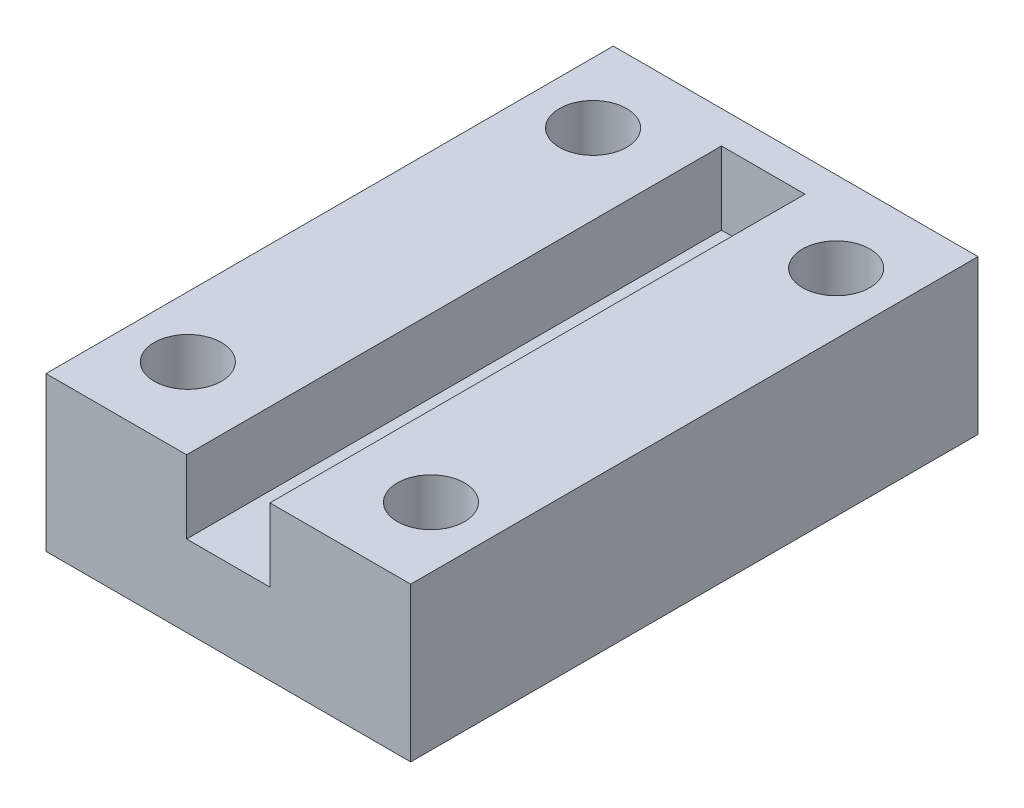
ISO-10303-21;
HEADER;
FILE_DESCRIPTION(('STEP AP214'),'2;1');
FILE_NAME('part.step','',(''),(''),'','','');
FILE_SCHEMA(('AUTOMOTIVE_DESIGN { 1 0 10303 214 1 1 1 1 }'));
ENDSEC;
DATA;
#1=APPLICATION_CONTEXT('core data for automotive mechanical design processes');
#2=APPLICATION_PROTOCOL_DEFINITION('international standard','automotive_design',2000,#1);
#3=PRODUCT_CONTEXT('',#1,'mechanical');
#4=PRODUCT('Part','Part','',(#3));
#5=PRODUCT_RELATED_PRODUCT_CATEGORY('part','',(#4));
#6=PRODUCT_DEFINITION_FORMATION('','',#4);
#7=PRODUCT_DEFINITION_CONTEXT('part definition',#1,'design');
#8=PRODUCT_DEFINITION('design','',#6,#7);
#9=PRODUCT_DEFINITION_SHAPE('','',#8);
#10=(LENGTH_UNIT() NAMED_UNIT(*) SI_UNIT(.MILLI.,.METRE.));
#11=(NAMED_UNIT(*) PLANE_ANGLE_UNIT() SI_UNIT($,.RADIAN.));
#12=(NAMED_UNIT(*) SI_UNIT($,.STERADIAN.) SOLID_ANGLE_UNIT());
#13=UNCERTAINTY_MEASURE_WITH_UNIT(LENGTH_MEASURE(1.E-05),#10,'distance_accuracy_value','');
#14=(GEOMETRIC_REPRESENTATION_CONTEXT(3) GLOBAL_UNCERTAINTY_ASSIGNED_CONTEXT((#13)) GLOBAL_UNIT_ASSIGNED_CONTEXT((#10,
#11,#12)) REPRESENTATION_CONTEXT('',''));
#15=CARTESIAN_POINT('',(0.,0.,0.));
#16=DIRECTION('',(0.,0.,1.));
#17=DIRECTION('',(1.,0.,0.));
#18=AXIS2_PLACEMENT_3D('',#15,#16,#17);
#19=CARTESIAN_POINT('',(-22.5,10.,35.));
#20=DIRECTION('',(1.,0.,0.));
#21=DIRECTION('',(0.,0.,-1.));
#22=AXIS2_PLACEMENT_3D('',#19,#20,#21);
#23=PLANE('',#22);
#24=DIRECTION('',(0.,0.,1.));
#25=VECTOR('',#24,1.);
#26=CARTESIAN_POINT('',(-22.5,0.,35.));
#27=LINE('',#26,#25);
#28=CARTESIAN_POINT('',(-22.5,0.,-35.));
#29=VERTEX_POINT('',#28);
#30=CARTESIAN_POINT('',(-22.5,0.,35.));
#31=VERTEX_POINT('',#30);
#32=EDGE_CURVE('E170',#29,#31,#27,.T.);
#33=ORIENTED_EDGE('',*,*,#32,.T.);
#34=DIRECTION('',(0.,-1.,0.));
#35=VECTOR('',#34,1.);
#36=CARTESIAN_POINT('',(-22.5,10.,35.));
#37=LINE('',#36,#35);
#38=CARTESIAN_POINT('',(-22.5,19.,35.));
#39=VERTEX_POINT('',#38);
#40=EDGE_CURVE('E120',#39,#31,#37,.T.);
#41=ORIENTED_EDGE('',*,*,#40,.F.);
#42=DIRECTION('',(0.,0.,1.));
#43=VECTOR('',#42,1.);
#44=CARTESIAN_POINT('',(-22.5,19.,35.));
#45=LINE('',#44,#43);
#46=CARTESIAN_POINT('',(-22.5,19.,-35.));
#47=VERTEX_POINT('',#46);
#48=EDGE_CURVE('E118',#47,#39,#45,.T.);
#49=ORIENTED_EDGE('',*,*,#48,.F.);
#50=DIRECTION('',(0.,-1.,0.));
#51=VECTOR('',#50,1.);
#52=CARTESIAN_POINT('',(-22.5,10.,-35.));
#53=LINE('',#52,#51);
#54=EDGE_CURVE('E103',#47,#29,#53,.T.);
#55=ORIENTED_EDGE('',*,*,#54,.T.);
#56=EDGE_LOOP('',(#33,#41,#49,#55));
#57=FACE_BOUND('',#56,.T.);
#58=ADVANCED_FACE('F34',(#57),#23,.F.);
#59=CARTESIAN_POINT('',(22.5,10.,35.));
#60=DIRECTION('',(0.,0.,-1.));
#61=DIRECTION('',(-1.,0.,0.));
#62=AXIS2_PLACEMENT_3D('',#59,#60,#61);
#63=PLANE('',#62);
#64=DIRECTION('',(1.,0.,0.));
#65=VECTOR('',#64,1.);
#66=CARTESIAN_POINT('',(22.5,0.,35.));
#67=LINE('',#66,#65);
#68=CARTESIAN_POINT('',(22.5,0.,35.));
#69=VERTEX_POINT('',#68);
#70=EDGE_CURVE('E173',#31,#69,#67,.T.);
#71=ORIENTED_EDGE('',*,*,#70,.T.);
#72=DIRECTION('',(0.,-1.,0.));
#73=VECTOR('',#72,1.);
#74=CARTESIAN_POINT('',(22.5,10.,35.));
#75=LINE('',#74,#73);
#76=CARTESIAN_POINT('',(22.5,19.,35.));
#77=VERTEX_POINT('',#76);
#78=EDGE_CURVE('E179',#77,#69,#75,.T.);
#79=ORIENTED_EDGE('',*,*,#78,.F.);
#80=DIRECTION('',(1.,0.,0.));
#81=VECTOR('',#80,1.);
#82=CARTESIAN_POINT('',(5.15,19.,35.));
#83=LINE('',#82,#81);
#84=CARTESIAN_POINT('',(5.15,19.,35.));
#85=VERTEX_POINT('',#84);
#86=EDGE_CURVE('E146',#85,#77,#83,.T.);
#87=ORIENTED_EDGE('',*,*,#86,.F.);
#88=DIRECTION('',(0.,-1.,0.));
#89=VECTOR('',#88,1.);
#90=CARTESIAN_POINT('',(5.15,19.,35.));
#91=LINE('',#90,#89);
#92=CARTESIAN_POINT('',(5.15,10.,35.));
#93=VERTEX_POINT('',#92);
#94=EDGE_CURVE('E149',#85,#93,#91,.T.);
#95=ORIENTED_EDGE('',*,*,#94,.T.);
#96=DIRECTION('',(1.,0.,0.));
#97=VECTOR('',#96,1.);
#98=CARTESIAN_POINT('',(22.5,10.,35.));
#99=LINE('',#98,#97);
#100=CARTESIAN_POINT('',(-5.15,10.,35.));
#101=VERTEX_POINT('',#100);
#102=EDGE_CURVE('E115',#101,#93,#99,.T.);
#103=ORIENTED_EDGE('',*,*,#102,.F.);
#104=DIRECTION('',(0.,-1.,0.));
#105=VECTOR('',#104,1.);
#106=CARTESIAN_POINT('',(-5.15,19.,35.));
#107=LINE('',#106,#105);
#108=CARTESIAN_POINT('',(-5.15,19.,35.));
#109=VERTEX_POINT('',#108);
#110=EDGE_CURVE('E167',#109,#101,#107,.T.);
#111=ORIENTED_EDGE('',*,*,#110,.F.);
#112=DIRECTION('',(1.,0.,0.));
#113=VECTOR('',#112,1.);
#114=CARTESIAN_POINT('',(-5.15,19.,35.));
#115=LINE('',#114,#113);
#116=EDGE_CURVE('E123',#39,#109,#115,.T.);
#117=ORIENTED_EDGE('',*,*,#116,.F.);
#118=ORIENTED_EDGE('',*,*,#40,.T.);
#119=EDGE_LOOP('',(#71,#79,#87,#95,#103,#111,#117,#118));
#120=FACE_BOUND('',#119,.T.);
#121=ADVANCED_FACE('F220',(#120),#63,.F.);
#122=CARTESIAN_POINT('',(22.5,10.,35.));
#123=DIRECTION('',(-1.,0.,0.));
#124=DIRECTION('',(0.,0.,1.));
#125=AXIS2_PLACEMENT_3D('',#122,#123,#124);
#126=PLANE('',#125);
#127=DIRECTION('',(0.,0.,-1.));
#128=VECTOR('',#127,1.);
#129=CARTESIAN_POINT('',(22.5,0.,35.));
#130=LINE('',#129,#128);
#131=CARTESIAN_POINT('',(22.5,0.,-35.));
#132=VERTEX_POINT('',#131);
#133=EDGE_CURVE('E175',#69,#132,#130,.T.);
#134=ORIENTED_EDGE('',*,*,#133,.T.);
#135=DIRECTION('',(0.,-1.,0.));
#136=VECTOR('',#135,1.);
#137=CARTESIAN_POINT('',(22.5,10.,-35.));
#138=LINE('',#137,#136);
#139=CARTESIAN_POINT('',(22.5,19.,-35.));
#140=VERTEX_POINT('',#139);
#141=EDGE_CURVE('E114',#140,#132,#138,.T.);
#142=ORIENTED_EDGE('',*,*,#141,.F.);
#143=DIRECTION('',(0.,0.,-1.));
#144=VECTOR('',#143,1.);
#145=CARTESIAN_POINT('',(22.5,19.,35.));
#146=LINE('',#145,#144);
#147=EDGE_CURVE('E130',#77,#140,#146,.T.);
#148=ORIENTED_EDGE('',*,*,#147,.F.);
#149=ORIENTED_EDGE('',*,*,#78,.T.);
#150=EDGE_LOOP('',(#134,#142,#148,#149));
#151=FACE_BOUND('',#150,.T.);
#152=ADVANCED_FACE('F225',(#151),#126,.F.);
#153=CARTESIAN_POINT('',(22.5,10.,-35.));
#154=DIRECTION('',(0.,0.,1.));
#155=DIRECTION('',(1.,0.,0.));
#156=AXIS2_PLACEMENT_3D('',#153,#154,#155);
#157=PLANE('',#156);
#158=DIRECTION('',(-1.,0.,0.));
#159=VECTOR('',#158,1.);
#160=CARTESIAN_POINT('',(22.5,0.,-35.));
#161=LINE('',#160,#159);
#162=EDGE_CURVE('E110',#132,#29,#161,.T.);
#163=ORIENTED_EDGE('',*,*,#162,.T.);
#164=ORIENTED_EDGE('',*,*,#54,.F.);
#165=DIRECTION('',(-1.,0.,0.));
#166=VECTOR('',#165,1.);
#167=CARTESIAN_POINT('',(-22.5,19.,-35.));
#168=LINE('',#167,#166);
#169=EDGE_CURVE('E108',#140,#47,#168,.T.);
#170=ORIENTED_EDGE('',*,*,#169,.F.);
#171=ORIENTED_EDGE('',*,*,#141,.T.);
#172=EDGE_LOOP('',(#163,#164,#170,#171));
#173=FACE_BOUND('',#172,.T.);
#174=ADVANCED_FACE('F105',(#173),#157,.F.);
#175=CARTESIAN_POINT('',(0.,10.,0.));
#176=DIRECTION('',(0.,1.,0.));
#177=DIRECTION('',(0.,0.,1.));
#178=AXIS2_PLACEMENT_3D('',#175,#176,#177);
#179=PLANE('',#178);
#180=DIRECTION('',(0.363344208928321,0.,0.93165497145577));
#181=VECTOR('',#180,1.);
#182=CARTESIAN_POINT('',(5.15,10.,35.));
#183=LINE('',#182,#181);
#184=CARTESIAN_POINT('',(5.13022934751461,10.,34.9493058476664));
#185=VERTEX_POINT('',#184);
#186=EDGE_CURVE('E49',#185,#93,#183,.T.);
#187=ORIENTED_EDGE('',*,*,#186,.F.);
#188=DIRECTION('',(-0.000299785590505607,0.,0.999999955064299));
#189=VECTOR('',#188,1.);
#190=CARTESIAN_POINT('',(5.15,10.,-31.));
#191=LINE('',#190,#189);
#192=CARTESIAN_POINT('',(5.15,10.,-31.));
#193=VERTEX_POINT('',#192);
#194=EDGE_CURVE('E53',#193,#185,#191,.T.);
#195=ORIENTED_EDGE('',*,*,#194,.F.);
#196=DIRECTION('',(1.,0.,0.));
#197=VECTOR('',#196,1.);
#198=CARTESIAN_POINT('',(-5.15,10.,-31.));
#199=LINE('',#198,#197);
#200=CARTESIAN_POINT('',(-5.15,10.,-31.));
#201=VERTEX_POINT('',#200);
#202=EDGE_CURVE('E153',#201,#193,#199,.T.);
#203=ORIENTED_EDGE('',*,*,#202,.F.);
#204=DIRECTION('',(0.,0.,-1.));
#205=VECTOR('',#204,1.);
#206=CARTESIAN_POINT('',(-5.15,10.,35.));
#207=LINE('',#206,#205);
#208=EDGE_CURVE('E150',#101,#201,#207,.T.);
#209=ORIENTED_EDGE('',*,*,#208,.F.);
#210=ORIENTED_EDGE('',*,*,#102,.T.);
#211=EDGE_LOOP('',(#187,#195,#203,#209,#210));
#212=FACE_BOUND('',#211,.T.);
#213=ADVANCED_FACE('F288',(#212),#179,.T.);
#214=CARTESIAN_POINT('',(0.,0.,0.));
#215=DIRECTION('',(0.,1.,0.));
#216=DIRECTION('',(0.,0.,1.));
#217=AXIS2_PLACEMENT_3D('',#214,#215,#216);
#218=PLANE('',#217);
#219=CARTESIAN_POINT('',(15.,0.,25.));
#220=DIRECTION('',(0.,1.,0.));
#221=DIRECTION('',(0.,0.,1.));
#222=AXIS2_PLACEMENT_3D('',#219,#220,#221);
#223=CIRCLE('',#222,5.15000000000001);
#224=CARTESIAN_POINT('',(15.,0.,30.15));
#225=VERTEX_POINT('',#224);
#226=EDGE_CURVE('E195',#225,#225,#223,.T.);
#227=ORIENTED_EDGE('',*,*,#226,.T.);
#228=EDGE_LOOP('',(#227));
#229=FACE_BOUND('',#228,.T.);
#230=CARTESIAN_POINT('',(-15.,0.,25.));
#231=DIRECTION('',(0.,1.,0.));
#232=DIRECTION('',(0.,0.,1.));
#233=AXIS2_PLACEMENT_3D('',#230,#231,#232);
#234=CIRCLE('',#233,5.15000000000001);
#235=CARTESIAN_POINT('',(-15.,0.,30.15));
#236=VERTEX_POINT('',#235);
#237=EDGE_CURVE('E192',#236,#236,#234,.T.);
#238=ORIENTED_EDGE('',*,*,#237,.T.);
#239=EDGE_LOOP('',(#238));
#240=FACE_BOUND('',#239,.T.);
#241=CARTESIAN_POINT('',(-15.,0.,-25.));
#242=DIRECTION('',(0.,1.,0.));
#243=DIRECTION('',(0.,0.,1.));
#244=AXIS2_PLACEMENT_3D('',#241,#242,#243);
#245=CIRCLE('',#244,5.15000000000001);
#246=CARTESIAN_POINT('',(-15.,0.,-19.85));
#247=VERTEX_POINT('',#246);
#248=EDGE_CURVE('E189',#247,#247,#245,.T.);
#249=ORIENTED_EDGE('',*,*,#248,.T.);
#250=EDGE_LOOP('',(#249));
#251=FACE_BOUND('',#250,.T.);
#252=CARTESIAN_POINT('',(15.,0.,-25.));
#253=DIRECTION('',(0.,1.,0.));
#254=DIRECTION('',(0.,0.,1.));
#255=AXIS2_PLACEMENT_3D('',#252,#253,#254);
#256=CIRCLE('',#255,5.15000000000001);
#257=CARTESIAN_POINT('',(15.,0.,-19.85));
#258=VERTEX_POINT('',#257);
#259=EDGE_CURVE('E186',#258,#258,#256,.T.);
#260=ORIENTED_EDGE('',*,*,#259,.T.);
#261=EDGE_LOOP('',(#260));
#262=FACE_BOUND('',#261,.T.);
#263=ORIENTED_EDGE('',*,*,#32,.F.);
#264=ORIENTED_EDGE('',*,*,#162,.F.);
#265=ORIENTED_EDGE('',*,*,#133,.F.);
#266=ORIENTED_EDGE('',*,*,#70,.F.);
#267=EDGE_LOOP('',(#263,#264,#265,#266));
#268=FACE_BOUND('',#267,.T.);
#269=ADVANCED_FACE('F287',(#229,#240,#251,#262,#268),#218,.F.);
#270=CARTESIAN_POINT('',(-15.,10.,-25.));
#271=DIRECTION('',(0.,-1.,0.));
#272=DIRECTION('',(0.,0.,-1.));
#273=AXIS2_PLACEMENT_3D('',#270,#271,#272);
#274=CYLINDRICAL_SURFACE('',#273,4.15);
#275=CARTESIAN_POINT('',(-15.,1.19175359259421,-25.));
#276=DIRECTION('',(0.,1.,0.));
#277=DIRECTION('',(0.,0.,1.));
#278=AXIS2_PLACEMENT_3D('',#275,#276,#277);
#279=CIRCLE('',#278,4.15);
#280=CARTESIAN_POINT('',(-15.,1.19175359259421,-20.85));
#281=VERTEX_POINT('',#280);
#282=EDGE_CURVE('E42',#281,#281,#279,.F.);
#283=ORIENTED_EDGE('',*,*,#282,.T.);
#284=EDGE_LOOP('',(#283));
#285=FACE_BOUND('',#284,.T.);
#286=CARTESIAN_POINT('',(-15.,19.,-25.));
#287=DIRECTION('',(0.,1.,0.));
#288=DIRECTION('',(0.,0.,1.));
#289=AXIS2_PLACEMENT_3D('',#286,#287,#288);
#290=CIRCLE('',#289,4.15);
#291=CARTESIAN_POINT('',(-15.,19.,-20.85));
#292=VERTEX_POINT('',#291);
#293=EDGE_CURVE('E134',#292,#292,#290,.T.);
#294=ORIENTED_EDGE('',*,*,#293,.T.);
#295=EDGE_LOOP('',(#294));
#296=FACE_BOUND('',#295,.T.);
#297=ADVANCED_FACE('F203',(#285,#296),#274,.F.);
#298=CARTESIAN_POINT('',(15.,10.,-25.));
#299=DIRECTION('',(0.,-1.,0.));
#300=DIRECTION('',(0.,0.,-1.));
#301=AXIS2_PLACEMENT_3D('',#298,#299,#300);
#302=CYLINDRICAL_SURFACE('',#301,4.15);
#303=CARTESIAN_POINT('',(15.,1.19175359259421,-25.));
#304=DIRECTION('',(0.,1.,0.));
#305=DIRECTION('',(0.,0.,1.));
#306=AXIS2_PLACEMENT_3D('',#303,#304,#305);
#307=CIRCLE('',#306,4.15);
#308=CARTESIAN_POINT('',(15.,1.19175359259421,-20.85));
#309=VERTEX_POINT('',#308);
#310=EDGE_CURVE('E11',#309,#309,#307,.F.);
#311=ORIENTED_EDGE('',*,*,#310,.T.);
#312=EDGE_LOOP('',(#311));
#313=FACE_BOUND('',#312,.T.);
#314=CARTESIAN_POINT('',(15.,19.,-25.));
#315=DIRECTION('',(0.,1.,0.));
#316=DIRECTION('',(0.,0.,1.));
#317=AXIS2_PLACEMENT_3D('',#314,#315,#316);
#318=CIRCLE('',#317,4.15);
#319=CARTESIAN_POINT('',(15.,19.,-20.85));
#320=VERTEX_POINT('',#319);
#321=EDGE_CURVE('E253',#320,#320,#318,.T.);
#322=ORIENTED_EDGE('',*,*,#321,.T.);
#323=EDGE_LOOP('',(#322));
#324=FACE_BOUND('',#323,.T.);
#325=ADVANCED_FACE('F247',(#313,#324),#302,.F.);
#326=CARTESIAN_POINT('',(15.,10.,25.));
#327=DIRECTION('',(0.,-1.,0.));
#328=DIRECTION('',(0.,0.,-1.));
#329=AXIS2_PLACEMENT_3D('',#326,#327,#328);
#330=CYLINDRICAL_SURFACE('',#329,4.15);
#331=CARTESIAN_POINT('',(15.,1.19175359259421,25.));
#332=DIRECTION('',(0.,1.,0.));
#333=DIRECTION('',(0.,0.,1.));
#334=AXIS2_PLACEMENT_3D('',#331,#332,#333);
#335=CIRCLE('',#334,4.15);
#336=CARTESIAN_POINT('',(15.,1.19175359259421,29.15));
#337=VERTEX_POINT('',#336);
#338=EDGE_CURVE('E183',#337,#337,#335,.F.);
#339=ORIENTED_EDGE('',*,*,#338,.T.);
#340=EDGE_LOOP('',(#339));
#341=FACE_BOUND('',#340,.T.);
#342=CARTESIAN_POINT('',(15.,19.,25.));
#343=DIRECTION('',(0.,1.,0.));
#344=DIRECTION('',(0.,0.,1.));
#345=AXIS2_PLACEMENT_3D('',#342,#343,#344);
#346=CIRCLE('',#345,4.15);
#347=CARTESIAN_POINT('',(15.,19.,29.15));
#348=VERTEX_POINT('',#347);
#349=EDGE_CURVE('E251',#348,#348,#346,.T.);
#350=ORIENTED_EDGE('',*,*,#349,.T.);
#351=EDGE_LOOP('',(#350));
#352=FACE_BOUND('',#351,.T.);
#353=ADVANCED_FACE('F243',(#341,#352),#330,.F.);
#354=CARTESIAN_POINT('',(-15.,10.,25.));
#355=DIRECTION('',(0.,-1.,0.));
#356=DIRECTION('',(0.,0.,-1.));
#357=AXIS2_PLACEMENT_3D('',#354,#355,#356);
#358=CYLINDRICAL_SURFACE('',#357,4.15);
#359=CARTESIAN_POINT('',(-15.,1.19175359259421,25.));
#360=DIRECTION('',(0.,1.,0.));
#361=DIRECTION('',(0.,0.,1.));
#362=AXIS2_PLACEMENT_3D('',#359,#360,#361);
#363=CIRCLE('',#362,4.15);
#364=CARTESIAN_POINT('',(-15.,1.19175359259421,29.15));
#365=VERTEX_POINT('',#364);
#366=EDGE_CURVE('E198',#365,#365,#363,.F.);
#367=ORIENTED_EDGE('',*,*,#366,.T.);
#368=EDGE_LOOP('',(#367));
#369=FACE_BOUND('',#368,.T.);
#370=CARTESIAN_POINT('',(-15.,19.,25.));
#371=DIRECTION('',(0.,1.,0.));
#372=DIRECTION('',(0.,0.,1.));
#373=AXIS2_PLACEMENT_3D('',#370,#371,#372);
#374=CIRCLE('',#373,4.15);
#375=CARTESIAN_POINT('',(-15.,19.,29.15));
#376=VERTEX_POINT('',#375);
#377=EDGE_CURVE('E254',#376,#376,#374,.T.);
#378=ORIENTED_EDGE('',*,*,#377,.T.);
#379=EDGE_LOOP('',(#378));
#380=FACE_BOUND('',#379,.T.);
#381=ADVANCED_FACE('F246',(#369,#380),#358,.F.);
#382=CARTESIAN_POINT('',(0.,19.,0.));
#383=DIRECTION('',(0.,1.,0.));
#384=DIRECTION('',(0.,0.,1.));
#385=AXIS2_PLACEMENT_3D('',#382,#383,#384);
#386=PLANE('',#385);
#387=ORIENTED_EDGE('',*,*,#349,.F.);
#388=EDGE_LOOP('',(#387));
#389=FACE_BOUND('',#388,.T.);
#390=ORIENTED_EDGE('',*,*,#293,.F.);
#391=EDGE_LOOP('',(#390));
#392=FACE_BOUND('',#391,.T.);
#393=ORIENTED_EDGE('',*,*,#169,.T.);
#394=ORIENTED_EDGE('',*,*,#48,.T.);
#395=ORIENTED_EDGE('',*,*,#116,.T.);
#396=DIRECTION('',(0.,0.,-1.));
#397=VECTOR('',#396,1.);
#398=CARTESIAN_POINT('',(-5.15,19.,35.));
#399=LINE('',#398,#397);
#400=CARTESIAN_POINT('',(-5.15,19.,-31.));
#401=VERTEX_POINT('',#400);
#402=EDGE_CURVE('E138',#109,#401,#399,.T.);
#403=ORIENTED_EDGE('',*,*,#402,.T.);
#404=DIRECTION('',(1.,0.,0.));
#405=VECTOR('',#404,1.);
#406=CARTESIAN_POINT('',(-5.15,19.,-31.));
#407=LINE('',#406,#405);
#408=CARTESIAN_POINT('',(5.15,19.,-31.));
#409=VERTEX_POINT('',#408);
#410=EDGE_CURVE('E140',#401,#409,#407,.T.);
#411=ORIENTED_EDGE('',*,*,#410,.T.);
#412=DIRECTION('',(-0.000299785590505607,0.,0.999999955064299));
#413=VECTOR('',#412,1.);
#414=CARTESIAN_POINT('',(5.15,19.,-31.));
#415=LINE('',#414,#413);
#416=CARTESIAN_POINT('',(5.13022934751461,19.,34.9493058476664));
#417=VERTEX_POINT('',#416);
#418=EDGE_CURVE('E142',#409,#417,#415,.T.);
#419=ORIENTED_EDGE('',*,*,#418,.T.);
#420=DIRECTION('',(0.363344208928321,0.,0.93165497145577));
#421=VECTOR('',#420,1.);
#422=CARTESIAN_POINT('',(5.15,19.,35.));
#423=LINE('',#422,#421);
#424=EDGE_CURVE('E144',#417,#85,#423,.T.);
#425=ORIENTED_EDGE('',*,*,#424,.T.);
#426=ORIENTED_EDGE('',*,*,#86,.T.);
#427=ORIENTED_EDGE('',*,*,#147,.T.);
#428=EDGE_LOOP('',(#393,#394,#395,#403,#411,#419,#425,#426,#427));
#429=FACE_BOUND('',#428,.T.);
#430=ORIENTED_EDGE('',*,*,#321,.F.);
#431=EDGE_LOOP('',(#430));
#432=FACE_BOUND('',#431,.T.);
#433=ORIENTED_EDGE('',*,*,#377,.F.);
#434=EDGE_LOOP('',(#433));
#435=FACE_BOUND('',#434,.T.);
#436=ADVANCED_FACE('F126',(#389,#392,#429,#432,#435),#386,.T.);
#437=CARTESIAN_POINT('',(-5.15,19.,35.));
#438=DIRECTION('',(-1.,0.,0.));
#439=DIRECTION('',(0.,0.,1.));
#440=AXIS2_PLACEMENT_3D('',#437,#438,#439);
#441=PLANE('',#440);
#442=ORIENTED_EDGE('',*,*,#208,.T.);
#443=DIRECTION('',(0.,-1.,0.));
#444=VECTOR('',#443,1.);
#445=CARTESIAN_POINT('',(-5.15,19.,-31.));
#446=LINE('',#445,#444);
#447=EDGE_CURVE('E164',#401,#201,#446,.T.);
#448=ORIENTED_EDGE('',*,*,#447,.F.);
#449=ORIENTED_EDGE('',*,*,#402,.F.);
#450=ORIENTED_EDGE('',*,*,#110,.T.);
#451=EDGE_LOOP('',(#442,#448,#449,#450));
#452=FACE_BOUND('',#451,.T.);
#453=ADVANCED_FACE('F263',(#452),#441,.F.);
#454=CARTESIAN_POINT('',(-5.15,19.,-31.));
#455=DIRECTION('',(0.,0.,-1.));
#456=DIRECTION('',(-1.,0.,0.));
#457=AXIS2_PLACEMENT_3D('',#454,#455,#456);
#458=PLANE('',#457);
#459=ORIENTED_EDGE('',*,*,#202,.T.);
#460=DIRECTION('',(0.,-1.,0.));
#461=VECTOR('',#460,1.);
#462=CARTESIAN_POINT('',(5.15,19.,-31.));
#463=LINE('',#462,#461);
#464=EDGE_CURVE('E161',#409,#193,#463,.T.);
#465=ORIENTED_EDGE('',*,*,#464,.F.);
#466=ORIENTED_EDGE('',*,*,#410,.F.);
#467=ORIENTED_EDGE('',*,*,#447,.T.);
#468=EDGE_LOOP('',(#459,#465,#466,#467));
#469=FACE_BOUND('',#468,.T.);
#470=ADVANCED_FACE('F269',(#469),#458,.F.);
#471=CARTESIAN_POINT('',(5.15,19.,-31.));
#472=DIRECTION('',(0.999999955064299,0.,0.000299785590505607));
#473=DIRECTION('',(0.000299785590505607,0.,-0.999999955064299));
#474=AXIS2_PLACEMENT_3D('',#471,#472,#473);
#475=PLANE('',#474);
#476=ORIENTED_EDGE('',*,*,#194,.T.);
#477=DIRECTION('',(0.,-1.,0.));
#478=VECTOR('',#477,1.);
#479=CARTESIAN_POINT('',(5.13022934751461,19.,34.9493058476664));
#480=LINE('',#479,#478);
#481=EDGE_CURVE('E158',#417,#185,#480,.T.);
#482=ORIENTED_EDGE('',*,*,#481,.F.);
#483=ORIENTED_EDGE('',*,*,#418,.F.);
#484=ORIENTED_EDGE('',*,*,#464,.T.);
#485=EDGE_LOOP('',(#476,#482,#483,#484));
#486=FACE_BOUND('',#485,.T.);
#487=ADVANCED_FACE('F236',(#486),#475,.F.);
#488=CARTESIAN_POINT('',(5.15,19.,35.));
#489=DIRECTION('',(0.931654971455771,0.,-0.363344208928321));
#490=DIRECTION('',(-0.363344208928321,0.,-0.931654971455771));
#491=AXIS2_PLACEMENT_3D('',#488,#489,#490);
#492=PLANE('',#491);
#493=ORIENTED_EDGE('',*,*,#186,.T.);
#494=ORIENTED_EDGE('',*,*,#94,.F.);
#495=ORIENTED_EDGE('',*,*,#424,.F.);
#496=ORIENTED_EDGE('',*,*,#481,.T.);
#497=EDGE_LOOP('',(#493,#494,#495,#496));
#498=FACE_BOUND('',#497,.T.);
#499=ADVANCED_FACE('F231',(#498),#492,.F.);
#500=CARTESIAN_POINT('',(15.,1.19175359259421,25.));
#501=DIRECTION('',(0.,-1.,0.));
#502=DIRECTION('',(0.,0.,-1.));
#503=AXIS2_PLACEMENT_3D('',#500,#501,#502);
#504=CONICAL_SURFACE('',#503,4.15,0.698131700797736);
#505=ORIENTED_EDGE('',*,*,#226,.F.);
#506=EDGE_LOOP('',(#505));
#507=FACE_BOUND('',#506,.T.);
#508=ORIENTED_EDGE('',*,*,#338,.F.);
#509=EDGE_LOOP('',(#508));
#510=FACE_BOUND('',#509,.T.);
#511=ADVANCED_FACE('F215',(#507,#510),#504,.F.);
#512=CARTESIAN_POINT('',(-15.,1.19175359259421,25.));
#513=DIRECTION('',(0.,-1.,0.));
#514=DIRECTION('',(0.,0.,-1.));
#515=AXIS2_PLACEMENT_3D('',#512,#513,#514);
#516=CONICAL_SURFACE('',#515,4.15,0.698131700797736);
#517=ORIENTED_EDGE('',*,*,#237,.F.);
#518=EDGE_LOOP('',(#517));
#519=FACE_BOUND('',#518,.T.);
#520=ORIENTED_EDGE('',*,*,#366,.F.);
#521=EDGE_LOOP('',(#520));
#522=FACE_BOUND('',#521,.T.);
#523=ADVANCED_FACE('F208',(#519,#522),#516,.F.);
#524=CARTESIAN_POINT('',(-15.,1.19175359259421,-25.));
#525=DIRECTION('',(0.,-1.,0.));
#526=DIRECTION('',(0.,0.,-1.));
#527=AXIS2_PLACEMENT_3D('',#524,#525,#526);
#528=CONICAL_SURFACE('',#527,4.15,0.698131700797736);
#529=ORIENTED_EDGE('',*,*,#248,.F.);
#530=EDGE_LOOP('',(#529));
#531=FACE_BOUND('',#530,.T.);
#532=ORIENTED_EDGE('',*,*,#282,.F.);
#533=EDGE_LOOP('',(#532));
#534=FACE_BOUND('',#533,.T.);
#535=ADVANCED_FACE('F206',(#531,#534),#528,.F.);
#536=CARTESIAN_POINT('',(15.,1.19175359259421,-25.));
#537=DIRECTION('',(0.,-1.,0.));
#538=DIRECTION('',(0.,0.,-1.));
#539=AXIS2_PLACEMENT_3D('',#536,#537,#538);
#540=CONICAL_SURFACE('',#539,4.15,0.698131700797735);
#541=ORIENTED_EDGE('',*,*,#259,.F.);
#542=EDGE_LOOP('',(#541));
#543=FACE_BOUND('',#542,.T.);
#544=ORIENTED_EDGE('',*,*,#310,.F.);
#545=EDGE_LOOP('',(#544));
#546=FACE_BOUND('',#545,.T.);
#547=ADVANCED_FACE('F36',(#543,#546),#540,.F.);
#548=CLOSED_SHELL('',(#58,#121,#152,#174,#213,#269,#297,#325,#353,#381,#436,#453,#470,#487,#499,
#511,#523,#535,#547));
#549=MANIFOLD_SOLID_BREP('B2',#548);
#550=ADVANCED_BREP_SHAPE_REPRESENTATION('',(#18,#549),#14);
#551=SHAPE_DEFINITION_REPRESENTATION(#9,#550);
ENDSEC;
END-ISO-10303-21;
